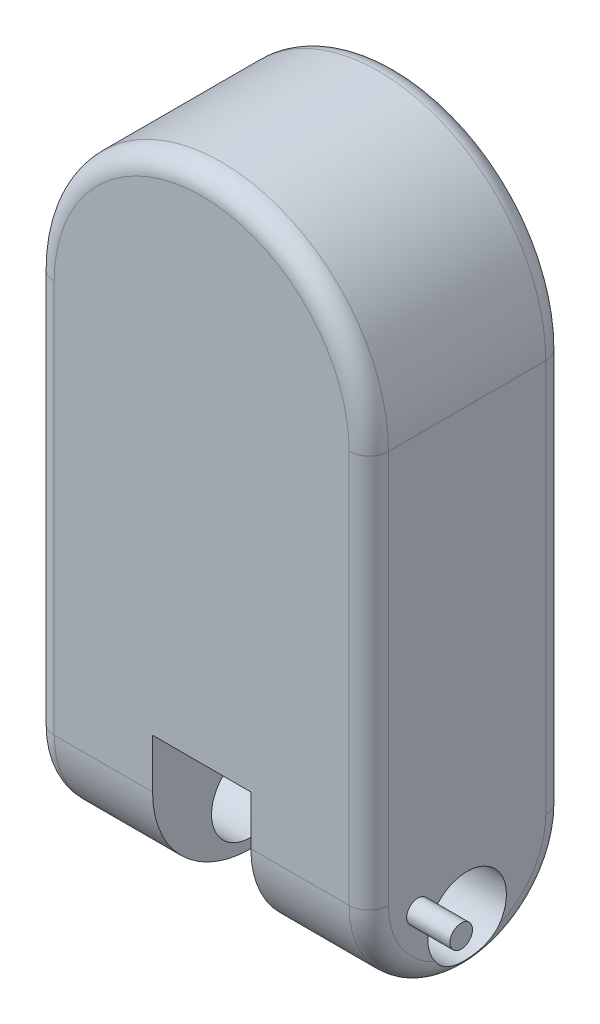
ISO-10303-21;
HEADER;
FILE_DESCRIPTION(('STEP AP214'),'2;1');
FILE_NAME('part.step','',(''),(''),'','','');
FILE_SCHEMA(('AUTOMOTIVE_DESIGN { 1 0 10303 214 1 1 1 1 }'));
ENDSEC;
DATA;
#1=APPLICATION_CONTEXT('core data for automotive mechanical design processes');
#2=APPLICATION_PROTOCOL_DEFINITION('international standard','automotive_design',2000,#1);
#3=PRODUCT_CONTEXT('',#1,'mechanical');
#4=PRODUCT('Part','Part','',(#3));
#5=PRODUCT_RELATED_PRODUCT_CATEGORY('part','',(#4));
#6=PRODUCT_DEFINITION_FORMATION('','',#4);
#7=PRODUCT_DEFINITION_CONTEXT('part definition',#1,'design');
#8=PRODUCT_DEFINITION('design','',#6,#7);
#9=PRODUCT_DEFINITION_SHAPE('','',#8);
#10=(LENGTH_UNIT() NAMED_UNIT(*) SI_UNIT(.MILLI.,.METRE.));
#11=(NAMED_UNIT(*) PLANE_ANGLE_UNIT() SI_UNIT($,.RADIAN.));
#12=(NAMED_UNIT(*) SI_UNIT($,.STERADIAN.) SOLID_ANGLE_UNIT());
#13=UNCERTAINTY_MEASURE_WITH_UNIT(LENGTH_MEASURE(1.E-05),#10,'distance_accuracy_value','');
#14=(GEOMETRIC_REPRESENTATION_CONTEXT(3) GLOBAL_UNCERTAINTY_ASSIGNED_CONTEXT((#13)) GLOBAL_UNIT_ASSIGNED_CONTEXT((#10,
#11,#12)) REPRESENTATION_CONTEXT('',''));
#15=CARTESIAN_POINT('',(0.,0.,0.));
#16=DIRECTION('',(0.,0.,1.));
#17=DIRECTION('',(1.,0.,0.));
#18=AXIS2_PLACEMENT_3D('',#15,#16,#17);
#19=CARTESIAN_POINT('',(-25.,-75.,-100.1));
#20=DIRECTION('',(0.,-1.,0.));
#21=DIRECTION('',(0.,0.,-1.));
#22=AXIS2_PLACEMENT_3D('',#19,#20,#21);
#23=PLANE('',#22);
#24=DIRECTION('',(1.,0.,0.));
#25=VECTOR('',#24,1.);
#26=CARTESIAN_POINT('',(-25.,-75.,-100.));
#27=LINE('',#26,#25);
#28=CARTESIAN_POINT('',(-25.,-75.,-100.));
#29=VERTEX_POINT('',#28);
#30=CARTESIAN_POINT('',(25.,-75.,-100.));
#31=VERTEX_POINT('',#30);
#32=EDGE_CURVE('E96',#29,#31,#27,.T.);
#33=ORIENTED_EDGE('',*,*,#32,.T.);
#34=CARTESIAN_POINT('',(23.5893264020334,-75.,-90.1));
#35=DIRECTION('',(0.,-1.,0.));
#36=DIRECTION('',(0.,0.,-1.));
#37=AXIS2_PLACEMENT_3D('',#34,#35,#36);
#38=CIRCLE('',#37,10.);
#39=CARTESIAN_POINT('',(23.5893264020334,-75.,-100.1));
#40=VERTEX_POINT('',#39);
#41=EDGE_CURVE('E12',#31,#40,#38,.F.);
#42=ORIENTED_EDGE('',*,*,#41,.T.);
#43=DIRECTION('',(1.,0.,0.));
#44=VECTOR('',#43,1.);
#45=CARTESIAN_POINT('',(-25.,-75.,-100.1));
#46=LINE('',#45,#44);
#47=CARTESIAN_POINT('',(-23.5893264020334,-75.,-100.1));
#48=VERTEX_POINT('',#47);
#49=EDGE_CURVE('E120',#48,#40,#46,.T.);
#50=ORIENTED_EDGE('',*,*,#49,.F.);
#51=CARTESIAN_POINT('',(-23.5893264020334,-75.,-90.1));
#52=DIRECTION('',(0.,-1.,0.));
#53=DIRECTION('',(0.,0.,-1.));
#54=AXIS2_PLACEMENT_3D('',#51,#52,#53);
#55=CIRCLE('',#54,10.);
#56=EDGE_CURVE('E59',#48,#29,#55,.F.);
#57=ORIENTED_EDGE('',*,*,#56,.T.);
#58=EDGE_LOOP('',(#33,#42,#50,#57));
#59=FACE_BOUND('',#58,.T.);
#60=ADVANCED_FACE('F50',(#59),#23,.F.);
#61=CARTESIAN_POINT('',(0.,0.,-100.1));
#62=DIRECTION('',(0.,0.,-1.));
#63=DIRECTION('',(-1.,0.,0.));
#64=AXIS2_PLACEMENT_3D('',#61,#62,#63);
#65=PLANE('',#64);
#66=ORIENTED_EDGE('',*,*,#49,.T.);
#67=DIRECTION('',(0.,1.,0.));
#68=VECTOR('',#67,1.);
#69=CARTESIAN_POINT('',(23.5893264020334,-105.,-100.1));
#70=LINE('',#69,#68);
#71=CARTESIAN_POINT('',(23.5893264020334,-103.589326402033,-100.1));
#72=VERTEX_POINT('',#71);
#73=EDGE_CURVE('E108',#40,#72,#70,.F.);
#74=ORIENTED_EDGE('',*,*,#73,.T.);
#75=DIRECTION('',(1.,0.,0.));
#76=VECTOR('',#75,1.);
#77=CARTESIAN_POINT('',(-25.,-103.589326402033,-100.1));
#78=LINE('',#77,#76);
#79=CARTESIAN_POINT('',(-23.5893264020334,-103.589326402033,-100.1));
#80=VERTEX_POINT('',#79);
#81=EDGE_CURVE('E74',#72,#80,#78,.F.);
#82=ORIENTED_EDGE('',*,*,#81,.T.);
#83=DIRECTION('',(0.,-1.,0.));
#84=VECTOR('',#83,1.);
#85=CARTESIAN_POINT('',(-23.5893264020334,-75.,-100.1));
#86=LINE('',#85,#84);
#87=EDGE_CURVE('E111',#80,#48,#86,.F.);
#88=ORIENTED_EDGE('',*,*,#87,.T.);
#89=EDGE_LOOP('',(#66,#74,#82,#88));
#90=FACE_BOUND('',#89,.T.);
#91=ADVANCED_FACE('F124',(#90),#65,.T.);
#92=CARTESIAN_POINT('',(0.,0.,-100.));
#93=DIRECTION('',(0.,0.,-1.));
#94=DIRECTION('',(-1.,0.,0.));
#95=AXIS2_PLACEMENT_3D('',#92,#93,#94);
#96=PLANE('',#95);
#97=ORIENTED_EDGE('',*,*,#32,.F.);
#98=DIRECTION('',(0.,1.,0.));
#99=VECTOR('',#98,1.);
#100=CARTESIAN_POINT('',(-25.,-105.,-100.));
#101=LINE('',#100,#99);
#102=CARTESIAN_POINT('',(-25.,-105.,-100.));
#103=VERTEX_POINT('',#102);
#104=EDGE_CURVE('E119',#103,#29,#101,.T.);
#105=ORIENTED_EDGE('',*,*,#104,.F.);
#106=DIRECTION('',(-1.,0.,0.));
#107=VECTOR('',#106,1.);
#108=CARTESIAN_POINT('',(25.,-105.,-100.));
#109=LINE('',#108,#107);
#110=CARTESIAN_POINT('',(25.,-105.,-100.));
#111=VERTEX_POINT('',#110);
#112=EDGE_CURVE('E99',#111,#103,#109,.T.);
#113=ORIENTED_EDGE('',*,*,#112,.F.);
#114=DIRECTION('',(0.,-1.,0.));
#115=VECTOR('',#114,1.);
#116=CARTESIAN_POINT('',(25.,-75.,-100.));
#117=LINE('',#116,#115);
#118=EDGE_CURVE('E93',#31,#111,#117,.T.);
#119=ORIENTED_EDGE('',*,*,#118,.F.);
#120=EDGE_LOOP('',(#97,#105,#113,#119));
#121=FACE_BOUND('',#120,.T.);
#122=ADVANCED_FACE('F95',(#121),#96,.F.);
#123=CARTESIAN_POINT('',(-23.5893264020334,-105.,-90.1));
#124=DIRECTION('',(0.,1.,0.));
#125=DIRECTION('',(0.,0.,1.));
#126=AXIS2_PLACEMENT_3D('',#123,#124,#125);
#127=CYLINDRICAL_SURFACE('',#126,10.);
#128=ORIENTED_EDGE('',*,*,#56,.F.);
#129=ORIENTED_EDGE('',*,*,#87,.F.);
#130=CARTESIAN_POINT('',(-23.5893264020334,-103.589326402033,-90.1));
#131=DIRECTION('',(-0.707106781186547,0.707106781186547,0.));
#132=DIRECTION('',(0.707106781186547,0.707106781186547,0.));
#133=AXIS2_PLACEMENT_3D('',#130,#131,#132);
#134=ELLIPSE('',#133,14.1421356237309,10.);
#135=EDGE_CURVE('E54',#103,#80,#134,.F.);
#136=ORIENTED_EDGE('',*,*,#135,.F.);
#137=ORIENTED_EDGE('',*,*,#104,.T.);
#138=EDGE_LOOP('',(#128,#129,#136,#137));
#139=FACE_BOUND('',#138,.T.);
#140=ADVANCED_FACE('F52',(#139),#127,.T.);
#141=CARTESIAN_POINT('',(25.,-103.589326402033,-90.1));
#142=DIRECTION('',(-1.,0.,0.));
#143=DIRECTION('',(0.,0.,1.));
#144=AXIS2_PLACEMENT_3D('',#141,#142,#143);
#145=CYLINDRICAL_SURFACE('',#144,10.);
#146=ORIENTED_EDGE('',*,*,#135,.T.);
#147=ORIENTED_EDGE('',*,*,#81,.F.);
#148=CARTESIAN_POINT('',(23.5893264020334,-103.589326402033,-90.1));
#149=DIRECTION('',(-0.707106781186547,-0.707106781186548,0.));
#150=DIRECTION('',(-0.707106781186548,0.707106781186547,0.));
#151=AXIS2_PLACEMENT_3D('',#148,#149,#150);
#152=ELLIPSE('',#151,14.142135623731,10.);
#153=EDGE_CURVE('E67',#111,#72,#152,.F.);
#154=ORIENTED_EDGE('',*,*,#153,.F.);
#155=ORIENTED_EDGE('',*,*,#112,.T.);
#156=EDGE_LOOP('',(#146,#147,#154,#155));
#157=FACE_BOUND('',#156,.T.);
#158=ADVANCED_FACE('F117',(#157),#145,.T.);
#159=CARTESIAN_POINT('',(23.5893264020334,-75.,-90.1));
#160=DIRECTION('',(0.,-1.,0.));
#161=DIRECTION('',(1.,0.,0.));
#162=AXIS2_PLACEMENT_3D('',#159,#160,#161);
#163=CYLINDRICAL_SURFACE('',#162,10.);
#164=ORIENTED_EDGE('',*,*,#41,.F.);
#165=ORIENTED_EDGE('',*,*,#118,.T.);
#166=ORIENTED_EDGE('',*,*,#153,.T.);
#167=ORIENTED_EDGE('',*,*,#73,.F.);
#168=EDGE_LOOP('',(#164,#165,#166,#167));
#169=FACE_BOUND('',#168,.T.);
#170=ADVANCED_FACE('F107',(#169),#163,.T.);
#171=CLOSED_SHELL('',(#60,#91,#122,#140,#158,#170));
#172=MANIFOLD_SOLID_BREP('B2',#171);
#173=CARTESIAN_POINT('',(0.,-75.,-50.));
#174=DIRECTION('',(1.,0.,0.));
#175=DIRECTION('',(0.,0.,-1.));
#176=AXIS2_PLACEMENT_3D('',#173,#174,#175);
#177=CYLINDRICAL_SURFACE('',#176,50.);
#178=DIRECTION('',(1.,0.,0.));
#179=VECTOR('',#178,1.);
#180=CARTESIAN_POINT('',(0.,-75.,0.));
#181=LINE('',#180,#179);
#182=CARTESIAN_POINT('',(-75.,-75.,0.));
#183=VERTEX_POINT('',#182);
#184=CARTESIAN_POINT('',(-25.,-75.,0.));
#185=VERTEX_POINT('',#184);
#186=EDGE_CURVE('E397',#183,#185,#181,.T.);
#187=ORIENTED_EDGE('',*,*,#186,.F.);
#188=CARTESIAN_POINT('',(-75.,-75.,-50.));
#189=DIRECTION('',(-1.,0.,0.));
#190=DIRECTION('',(0.,-1.,0.));
#191=AXIS2_PLACEMENT_3D('',#188,#189,#190);
#192=CIRCLE('',#191,50.);
#193=CARTESIAN_POINT('',(-75.,-125.,-50.));
#194=VERTEX_POINT('',#193);
#195=EDGE_CURVE('E197',#183,#194,#192,.F.);
#196=ORIENTED_EDGE('',*,*,#195,.T.);
#197=DIRECTION('',(1.,0.,0.));
#198=VECTOR('',#197,1.);
#199=CARTESIAN_POINT('',(-85.,-125.,-50.));
#200=LINE('',#199,#198);
#201=CARTESIAN_POINT('',(-25.,-125.,-50.));
#202=VERTEX_POINT('',#201);
#203=EDGE_CURVE('E353',#202,#194,#200,.F.);
#204=ORIENTED_EDGE('',*,*,#203,.F.);
#205=CARTESIAN_POINT('',(-25.,-75.,-50.));
#206=DIRECTION('',(-1.,0.,0.));
#207=DIRECTION('',(0.,0.,1.));
#208=AXIS2_PLACEMENT_3D('',#205,#206,#207);
#209=CIRCLE('',#208,50.);
#210=EDGE_CURVE('E372',#185,#202,#209,.F.);
#211=ORIENTED_EDGE('',*,*,#210,.F.);
#212=EDGE_LOOP('',(#187,#196,#204,#211));
#213=FACE_BOUND('',#212,.T.);
#214=ADVANCED_FACE('F174',(#213),#177,.T.);
#215=CARTESIAN_POINT('',(-85.,-75.,-50.));
#216=DIRECTION('',(-1.,0.,0.));
#217=DIRECTION('',(0.,0.,1.));
#218=AXIS2_PLACEMENT_3D('',#215,#216,#217);
#219=CYLINDRICAL_SURFACE('',#218,50.);
#220=ORIENTED_EDGE('',*,*,#203,.T.);
#221=CARTESIAN_POINT('',(-75.,-75.,-50.));
#222=DIRECTION('',(-1.,0.,0.));
#223=DIRECTION('',(0.,-1.,0.));
#224=AXIS2_PLACEMENT_3D('',#221,#222,#223);
#225=CIRCLE('',#224,50.);
#226=CARTESIAN_POINT('',(-75.,-75.,-100.));
#227=VERTEX_POINT('',#226);
#228=EDGE_CURVE('E183',#194,#227,#225,.F.);
#229=ORIENTED_EDGE('',*,*,#228,.T.);
#230=DIRECTION('',(1.,0.,0.));
#231=VECTOR('',#230,1.);
#232=CARTESIAN_POINT('',(-85.,-75.,-100.));
#233=LINE('',#232,#231);
#234=CARTESIAN_POINT('',(-25.,-75.,-100.));
#235=VERTEX_POINT('',#234);
#236=EDGE_CURVE('E392',#235,#227,#233,.F.);
#237=ORIENTED_EDGE('',*,*,#236,.F.);
#238=CARTESIAN_POINT('',(-25.,-75.,-50.));
#239=DIRECTION('',(-1.,0.,0.));
#240=DIRECTION('',(0.,0.,1.));
#241=AXIS2_PLACEMENT_3D('',#238,#239,#240);
#242=CIRCLE('',#241,50.);
#243=EDGE_CURVE('E381',#202,#235,#242,.F.);
#244=ORIENTED_EDGE('',*,*,#243,.F.);
#245=EDGE_LOOP('',(#220,#229,#237,#244));
#246=FACE_BOUND('',#245,.T.);
#247=ADVANCED_FACE('F510',(#246),#219,.T.);
#248=CARTESIAN_POINT('',(85.,125.,-100.));
#249=DIRECTION('',(1.,0.,0.));
#250=DIRECTION('',(0.,1.,0.));
#251=AXIS2_PLACEMENT_3D('',#248,#249,#250);
#252=PLANE('',#251);
#253=CARTESIAN_POINT('',(85.,-85.,-25.));
#254=DIRECTION('',(1.,0.,0.));
#255=DIRECTION('',(0.,1.,0.));
#256=AXIS2_PLACEMENT_3D('',#253,#254,#255);
#257=CIRCLE('',#256,5.75);
#258=CARTESIAN_POINT('',(85.,-79.25,-25.));
#259=VERTEX_POINT('',#258);
#260=EDGE_CURVE('E693',#259,#259,#257,.T.);
#261=ORIENTED_EDGE('',*,*,#260,.F.);
#262=EDGE_LOOP('',(#261));
#263=FACE_BOUND('',#262,.T.);
#264=CARTESIAN_POINT('',(85.,-75.,-50.));
#265=DIRECTION('',(1.,0.,0.));
#266=DIRECTION('',(0.,1.,0.));
#267=AXIS2_PLACEMENT_3D('',#264,#265,#266);
#268=CIRCLE('',#267,40.);
#269=CARTESIAN_POINT('',(85.0000000000001,-111.5,-66.3630681719536));
#270=VERTEX_POINT('',#269);
#271=CARTESIAN_POINT('',(85.,-75.,-90.));
#272=VERTEX_POINT('',#271);
#273=EDGE_CURVE('E429',#270,#272,#268,.T.);
#274=ORIENTED_EDGE('',*,*,#273,.T.);
#275=DIRECTION('',(0.,1.,0.));
#276=VECTOR('',#275,1.);
#277=CARTESIAN_POINT('',(85.,125.,-90.));
#278=LINE('',#277,#276);
#279=CARTESIAN_POINT('',(85.,125.,-90.));
#280=VERTEX_POINT('',#279);
#281=EDGE_CURVE('E432',#272,#280,#278,.T.);
#282=ORIENTED_EDGE('',*,*,#281,.T.);
#283=DIRECTION('',(0.,0.,1.));
#284=VECTOR('',#283,1.);
#285=CARTESIAN_POINT('',(85.,125.,-100.));
#286=LINE('',#285,#284);
#287=CARTESIAN_POINT('',(85.,125.,-9.99999999999999));
#288=VERTEX_POINT('',#287);
#289=EDGE_CURVE('E367',#280,#288,#286,.T.);
#290=ORIENTED_EDGE('',*,*,#289,.T.);
#291=DIRECTION('',(0.,1.,0.));
#292=VECTOR('',#291,1.);
#293=CARTESIAN_POINT('',(85.,125.,-9.99999999999999));
#294=LINE('',#293,#292);
#295=CARTESIAN_POINT('',(85.,-75.,-10.));
#296=VERTEX_POINT('',#295);
#297=EDGE_CURVE('E423',#288,#296,#294,.F.);
#298=ORIENTED_EDGE('',*,*,#297,.T.);
#299=CARTESIAN_POINT('',(85.,-75.,-50.));
#300=DIRECTION('',(1.,0.,0.));
#301=DIRECTION('',(0.,1.,0.));
#302=AXIS2_PLACEMENT_3D('',#299,#300,#301);
#303=CIRCLE('',#302,40.);
#304=CARTESIAN_POINT('',(85.,-111.5,-33.6369318280464));
#305=VERTEX_POINT('',#304);
#306=EDGE_CURVE('E426',#296,#305,#303,.T.);
#307=ORIENTED_EDGE('',*,*,#306,.T.);
#308=CARTESIAN_POINT('',(85.,-100.,-50.));
#309=DIRECTION('',(-1.,0.,0.));
#310=DIRECTION('',(0.,-1.,0.));
#311=AXIS2_PLACEMENT_3D('',#308,#309,#310);
#312=CIRCLE('',#311,20.);
#313=EDGE_CURVE('E354',#305,#270,#312,.T.);
#314=ORIENTED_EDGE('',*,*,#313,.T.);
#315=EDGE_LOOP('',(#274,#282,#290,#298,#307,#314));
#316=FACE_BOUND('',#315,.T.);
#317=ADVANCED_FACE('F515',(#263,#316),#252,.T.);
#318=CARTESIAN_POINT('',(-85.,125.,-100.));
#319=DIRECTION('',(-1.,0.,0.));
#320=DIRECTION('',(0.,-1.,0.));
#321=AXIS2_PLACEMENT_3D('',#318,#319,#320);
#322=PLANE('',#321);
#323=CARTESIAN_POINT('',(-85.,-75.,-50.));
#324=DIRECTION('',(-1.,0.,0.));
#325=DIRECTION('',(0.,-1.,0.));
#326=AXIS2_PLACEMENT_3D('',#323,#324,#325);
#327=CIRCLE('',#326,40.);
#328=CARTESIAN_POINT('',(-85.,-111.5,-33.6369318280464));
#329=VERTEX_POINT('',#328);
#330=CARTESIAN_POINT('',(-85.,-75.,-10.));
#331=VERTEX_POINT('',#330);
#332=EDGE_CURVE('E595',#329,#331,#327,.T.);
#333=ORIENTED_EDGE('',*,*,#332,.T.);
#334=DIRECTION('',(0.,-1.,0.));
#335=VECTOR('',#334,1.);
#336=CARTESIAN_POINT('',(-85.,125.,-9.99999999999999));
#337=LINE('',#336,#335);
#338=CARTESIAN_POINT('',(-85.,125.,-9.99999999999999));
#339=VERTEX_POINT('',#338);
#340=EDGE_CURVE('E481',#331,#339,#337,.F.);
#341=ORIENTED_EDGE('',*,*,#340,.T.);
#342=DIRECTION('',(0.,0.,1.));
#343=VECTOR('',#342,1.);
#344=CARTESIAN_POINT('',(-85.,125.,-100.));
#345=LINE('',#344,#343);
#346=CARTESIAN_POINT('',(-85.,125.,-90.));
#347=VERTEX_POINT('',#346);
#348=EDGE_CURVE('E368',#347,#339,#345,.T.);
#349=ORIENTED_EDGE('',*,*,#348,.F.);
#350=DIRECTION('',(0.,-1.,0.));
#351=VECTOR('',#350,1.);
#352=CARTESIAN_POINT('',(-85.,-75.,-90.));
#353=LINE('',#352,#351);
#354=CARTESIAN_POINT('',(-85.,-75.,-90.));
#355=VERTEX_POINT('',#354);
#356=EDGE_CURVE('E587',#347,#355,#353,.T.);
#357=ORIENTED_EDGE('',*,*,#356,.T.);
#358=CARTESIAN_POINT('',(-85.,-75.,-50.));
#359=DIRECTION('',(-1.,0.,0.));
#360=DIRECTION('',(0.,-1.,0.));
#361=AXIS2_PLACEMENT_3D('',#358,#359,#360);
#362=CIRCLE('',#361,40.);
#363=CARTESIAN_POINT('',(-85.,-111.5,-66.3630681719536));
#364=VERTEX_POINT('',#363);
#365=EDGE_CURVE('E593',#355,#364,#362,.T.);
#366=ORIENTED_EDGE('',*,*,#365,.T.);
#367=CARTESIAN_POINT('',(-85.,-100.,-50.));
#368=DIRECTION('',(-1.,0.,0.));
#369=DIRECTION('',(0.,-1.,0.));
#370=AXIS2_PLACEMENT_3D('',#367,#368,#369);
#371=CIRCLE('',#370,20.);
#372=EDGE_CURVE('E359',#329,#364,#371,.T.);
#373=ORIENTED_EDGE('',*,*,#372,.F.);
#374=EDGE_LOOP('',(#333,#341,#349,#357,#366,#373));
#375=FACE_BOUND('',#374,.T.);
#376=ADVANCED_FACE('F602',(#375),#322,.T.);
#377=CARTESIAN_POINT('',(0.,0.,-100.));
#378=DIRECTION('',(0.,0.,1.));
#379=DIRECTION('',(1.,0.,0.));
#380=AXIS2_PLACEMENT_3D('',#377,#378,#379);
#381=PLANE('',#380);
#382=CARTESIAN_POINT('',(0.,125.,-100.));
#383=DIRECTION('',(0.,0.,1.));
#384=DIRECTION('',(1.,0.,0.));
#385=AXIS2_PLACEMENT_3D('',#382,#383,#384);
#386=CIRCLE('',#385,75.);
#387=CARTESIAN_POINT('',(-75.,125.,-100.));
#388=VERTEX_POINT('',#387);
#389=CARTESIAN_POINT('',(75.,125.,-100.));
#390=VERTEX_POINT('',#389);
#391=EDGE_CURVE('E416',#388,#390,#386,.F.);
#392=ORIENTED_EDGE('',*,*,#391,.T.);
#393=DIRECTION('',(0.,1.,0.));
#394=VECTOR('',#393,1.);
#395=CARTESIAN_POINT('',(75.,-75.,-100.));
#396=LINE('',#395,#394);
#397=CARTESIAN_POINT('',(75.,-75.,-100.));
#398=VERTEX_POINT('',#397);
#399=EDGE_CURVE('E420',#390,#398,#396,.F.);
#400=ORIENTED_EDGE('',*,*,#399,.T.);
#401=CARTESIAN_POINT('',(25.,-75.,-100.));
#402=VERTEX_POINT('',#401);
#403=EDGE_CURVE('E398',#398,#402,#233,.F.);
#404=ORIENTED_EDGE('',*,*,#403,.T.);
#405=DIRECTION('',(-1.,0.,0.));
#406=VECTOR('',#405,1.);
#407=CARTESIAN_POINT('',(-25.,-75.,-100.));
#408=LINE('',#407,#406);
#409=EDGE_CURVE('E345',#402,#235,#408,.T.);
#410=ORIENTED_EDGE('',*,*,#409,.T.);
#411=ORIENTED_EDGE('',*,*,#236,.T.);
#412=DIRECTION('',(0.,-1.,0.));
#413=VECTOR('',#412,1.);
#414=CARTESIAN_POINT('',(-75.,125.,-100.));
#415=LINE('',#414,#413);
#416=EDGE_CURVE('E413',#227,#388,#415,.F.);
#417=ORIENTED_EDGE('',*,*,#416,.T.);
#418=EDGE_LOOP('',(#392,#400,#404,#410,#411,#417));
#419=FACE_BOUND('',#418,.T.);
#420=ADVANCED_FACE('F650',(#419),#381,.F.);
#421=CARTESIAN_POINT('',(0.,0.,0.));
#422=DIRECTION('',(0.,0.,1.));
#423=DIRECTION('',(1.,0.,0.));
#424=AXIS2_PLACEMENT_3D('',#421,#422,#423);
#425=PLANE('',#424);
#426=DIRECTION('',(0.,-1.,0.));
#427=VECTOR('',#426,1.);
#428=CARTESIAN_POINT('',(-25.,-75.,0.));
#429=LINE('',#428,#427);
#430=CARTESIAN_POINT('',(-25.,-50.,0.));
#431=VERTEX_POINT('',#430);
#432=EDGE_CURVE('E321',#431,#185,#429,.T.);
#433=ORIENTED_EDGE('',*,*,#432,.F.);
#434=DIRECTION('',(-1.,0.,0.));
#435=VECTOR('',#434,1.);
#436=CARTESIAN_POINT('',(-25.,-50.,0.));
#437=LINE('',#436,#435);
#438=CARTESIAN_POINT('',(25.,-50.,0.));
#439=VERTEX_POINT('',#438);
#440=EDGE_CURVE('E332',#439,#431,#437,.T.);
#441=ORIENTED_EDGE('',*,*,#440,.F.);
#442=DIRECTION('',(0.,1.,0.));
#443=VECTOR('',#442,1.);
#444=CARTESIAN_POINT('',(25.,-50.,0.));
#445=LINE('',#444,#443);
#446=CARTESIAN_POINT('',(25.,-75.,0.));
#447=VERTEX_POINT('',#446);
#448=EDGE_CURVE('E310',#447,#439,#445,.T.);
#449=ORIENTED_EDGE('',*,*,#448,.F.);
#450=CARTESIAN_POINT('',(75.,-75.,0.));
#451=VERTEX_POINT('',#450);
#452=EDGE_CURVE('E401',#447,#451,#181,.T.);
#453=ORIENTED_EDGE('',*,*,#452,.T.);
#454=DIRECTION('',(0.,1.,0.));
#455=VECTOR('',#454,1.);
#456=CARTESIAN_POINT('',(75.,0.,0.));
#457=LINE('',#456,#455);
#458=CARTESIAN_POINT('',(75.,125.,0.));
#459=VERTEX_POINT('',#458);
#460=EDGE_CURVE('E575',#451,#459,#457,.T.);
#461=ORIENTED_EDGE('',*,*,#460,.T.);
#462=CARTESIAN_POINT('',(0.,125.,0.));
#463=DIRECTION('',(0.,0.,1.));
#464=DIRECTION('',(1.,0.,0.));
#465=AXIS2_PLACEMENT_3D('',#462,#463,#464);
#466=CIRCLE('',#465,75.);
#467=CARTESIAN_POINT('',(-75.,125.,0.));
#468=VERTEX_POINT('',#467);
#469=EDGE_CURVE('E580',#459,#468,#466,.T.);
#470=ORIENTED_EDGE('',*,*,#469,.T.);
#471=DIRECTION('',(0.,-1.,0.));
#472=VECTOR('',#471,1.);
#473=CARTESIAN_POINT('',(-75.,0.,0.));
#474=LINE('',#473,#472);
#475=EDGE_CURVE('E543',#468,#183,#474,.T.);
#476=ORIENTED_EDGE('',*,*,#475,.T.);
#477=ORIENTED_EDGE('',*,*,#186,.T.);
#478=EDGE_LOOP('',(#433,#441,#449,#453,#461,#470,#476,#477));
#479=FACE_BOUND('',#478,.T.);
#480=ADVANCED_FACE('F662',(#479),#425,.T.);
#481=CARTESIAN_POINT('',(25.,-150.,-100.));
#482=DIRECTION('',(1.,0.,0.));
#483=DIRECTION('',(0.,0.,-1.));
#484=AXIS2_PLACEMENT_3D('',#481,#482,#483);
#485=PLANE('',#484);
#486=CARTESIAN_POINT('',(25.,-75.,-50.));
#487=DIRECTION('',(1.,0.,0.));
#488=DIRECTION('',(0.,0.,-1.));
#489=AXIS2_PLACEMENT_3D('',#486,#487,#488);
#490=CIRCLE('',#489,50.);
#491=CARTESIAN_POINT('',(25.,-125.,-50.));
#492=VERTEX_POINT('',#491);
#493=EDGE_CURVE('E385',#492,#447,#490,.F.);
#494=ORIENTED_EDGE('',*,*,#493,.T.);
#495=ORIENTED_EDGE('',*,*,#448,.T.);
#496=DIRECTION('',(0.,0.,1.));
#497=VECTOR('',#496,1.);
#498=CARTESIAN_POINT('',(25.,-50.,-99.));
#499=LINE('',#498,#497);
#500=CARTESIAN_POINT('',(25.,-50.,-99.));
#501=VERTEX_POINT('',#500);
#502=EDGE_CURVE('E302',#501,#439,#499,.T.);
#503=ORIENTED_EDGE('',*,*,#502,.F.);
#504=DIRECTION('',(0.,1.,0.));
#505=VECTOR('',#504,1.);
#506=CARTESIAN_POINT('',(25.,-50.,-99.));
#507=LINE('',#506,#505);
#508=CARTESIAN_POINT('',(25.,-74.4302970896538,-99.));
#509=VERTEX_POINT('',#508);
#510=EDGE_CURVE('E308',#509,#501,#507,.T.);
#511=ORIENTED_EDGE('',*,*,#510,.F.);
#512=CARTESIAN_POINT('',(25.,-161.602540378444,-50.));
#513=DIRECTION('',(1.,0.,0.));
#514=DIRECTION('',(0.,0.,-1.));
#515=AXIS2_PLACEMENT_3D('',#512,#513,#514);
#516=CIRCLE('',#515,100.);
#517=EDGE_CURVE('E346',#402,#509,#516,.T.);
#518=ORIENTED_EDGE('',*,*,#517,.F.);
#519=CARTESIAN_POINT('',(25.,-75.,-50.));
#520=DIRECTION('',(1.,0.,0.));
#521=DIRECTION('',(0.,0.,-1.));
#522=AXIS2_PLACEMENT_3D('',#519,#520,#521);
#523=CIRCLE('',#522,50.);
#524=EDGE_CURVE('E388',#402,#492,#523,.F.);
#525=ORIENTED_EDGE('',*,*,#524,.T.);
#526=EDGE_LOOP('',(#494,#495,#503,#511,#518,#525));
#527=FACE_BOUND('',#526,.T.);
#528=CARTESIAN_POINT('',(25.,-100.,-50.));
#529=DIRECTION('',(1.,0.,0.));
#530=DIRECTION('',(0.,0.,-1.));
#531=AXIS2_PLACEMENT_3D('',#528,#529,#530);
#532=CIRCLE('',#531,20.);
#533=CARTESIAN_POINT('',(25.,-100.,-70.));
#534=VERTEX_POINT('',#533);
#535=EDGE_CURVE('E363',#534,#534,#532,.T.);
#536=ORIENTED_EDGE('',*,*,#535,.T.);
#537=EDGE_LOOP('',(#536));
#538=FACE_BOUND('',#537,.T.);
#539=ADVANCED_FACE('F305',(#527,#538),#485,.F.);
#540=CARTESIAN_POINT('',(-25.,-150.,-100.));
#541=DIRECTION('',(-1.,0.,0.));
#542=DIRECTION('',(0.,0.,1.));
#543=AXIS2_PLACEMENT_3D('',#540,#541,#542);
#544=PLANE('',#543);
#545=ORIENTED_EDGE('',*,*,#432,.T.);
#546=ORIENTED_EDGE('',*,*,#210,.T.);
#547=ORIENTED_EDGE('',*,*,#243,.T.);
#548=CARTESIAN_POINT('',(-25.,-161.602540378444,-50.));
#549=DIRECTION('',(1.,0.,0.));
#550=DIRECTION('',(0.,0.,-1.));
#551=AXIS2_PLACEMENT_3D('',#548,#549,#550);
#552=CIRCLE('',#551,100.);
#553=CARTESIAN_POINT('',(-25.,-74.4302970896538,-99.));
#554=VERTEX_POINT('',#553);
#555=EDGE_CURVE('E341',#235,#554,#552,.T.);
#556=ORIENTED_EDGE('',*,*,#555,.T.);
#557=DIRECTION('',(0.,-1.,0.));
#558=VECTOR('',#557,1.);
#559=CARTESIAN_POINT('',(-25.,-75.,-99.));
#560=LINE('',#559,#558);
#561=CARTESIAN_POINT('',(-25.,-50.,-99.));
#562=VERTEX_POINT('',#561);
#563=EDGE_CURVE('E190',#562,#554,#560,.T.);
#564=ORIENTED_EDGE('',*,*,#563,.F.);
#565=DIRECTION('',(0.,0.,1.));
#566=VECTOR('',#565,1.);
#567=CARTESIAN_POINT('',(-25.,-50.,-99.));
#568=LINE('',#567,#566);
#569=EDGE_CURVE('E316',#562,#431,#568,.T.);
#570=ORIENTED_EDGE('',*,*,#569,.T.);
#571=EDGE_LOOP('',(#545,#546,#547,#556,#564,#570));
#572=FACE_BOUND('',#571,.T.);
#573=CARTESIAN_POINT('',(-25.,-100.,-50.));
#574=DIRECTION('',(-1.,0.,0.));
#575=DIRECTION('',(0.,0.,1.));
#576=AXIS2_PLACEMENT_3D('',#573,#574,#575);
#577=CIRCLE('',#576,20.);
#578=CARTESIAN_POINT('',(-25.,-100.,-30.));
#579=VERTEX_POINT('',#578);
#580=EDGE_CURVE('E358',#579,#579,#577,.T.);
#581=ORIENTED_EDGE('',*,*,#580,.T.);
#582=EDGE_LOOP('',(#581));
#583=FACE_BOUND('',#582,.T.);
#584=ADVANCED_FACE('F465',(#572,#583),#544,.F.);
#585=CARTESIAN_POINT('',(85.,-100.,-50.));
#586=DIRECTION('',(-1.,0.,0.));
#587=DIRECTION('',(0.,-1.,0.));
#588=AXIS2_PLACEMENT_3D('',#585,#586,#587);
#589=CYLINDRICAL_SURFACE('',#588,20.);
#590=CARTESIAN_POINT('',(-85.,-111.5,-66.3630681719536));
#591=CARTESIAN_POINT('',(-84.9999944988369,-111.717635786294,-66.2101150233157));
#592=CARTESIAN_POINT('',(-84.9972251505422,-111.932182024762,-66.0528421805291));
#593=CARTESIAN_POINT('',(-84.9867556613727,-112.35473388776,-65.7299474304971));
#594=CARTESIAN_POINT('',(-84.9790561221654,-112.562740307143,-65.5643265442968));
#595=CARTESIAN_POINT('',(-84.9494718778201,-113.176161814739,-65.0555886797702));
#596=CARTESIAN_POINT('',(-84.9210996400918,-113.571325329765,-64.7003530754296));
#597=CARTESIAN_POINT('',(-84.8515096756831,-114.330811895632,-63.9609577577295));
#598=CARTESIAN_POINT('',(-84.8103152955771,-114.695189480587,-63.576851568469));
#599=CARTESIAN_POINT('',(-84.7190573029856,-115.391950208584,-62.7815251896323));
#600=CARTESIAN_POINT('',(-84.6689923089183,-115.724328355308,-62.3703007827167));
#601=CARTESIAN_POINT('',(-84.5631593930954,-116.358618976357,-61.5187034560061));
#602=CARTESIAN_POINT('',(-84.5073357106278,-116.660163582177,-61.0780636594513));
#603=CARTESIAN_POINT('',(-84.3940622995594,-117.226993438192,-60.1742441935076));
#604=CARTESIAN_POINT('',(-84.3366125479803,-117.492278175682,-59.7110642055318));
#605=CARTESIAN_POINT('',(-84.223501755816,-117.985054029716,-58.7648363026767));
#606=CARTESIAN_POINT('',(-84.167840615512,-118.212547256171,-58.2817894988468));
#607=CARTESIAN_POINT('',(-84.0614849028067,-118.628363325728,-57.2985605452277));
#608=CARTESIAN_POINT('',(-84.0107905215469,-118.816684661646,-56.7983777369727));
#609=CARTESIAN_POINT('',(-83.914628020795,-119.162335252227,-55.7553050669512));
#610=CARTESIAN_POINT('',(-83.8696146444547,-119.31732359583,-55.2115959974652));
#611=CARTESIAN_POINT('',(-83.7912772213223,-119.580856141992,-54.1121164115952));
#612=CARTESIAN_POINT('',(-83.7579530630838,-119.689400787352,-53.5563460102591));
#613=CARTESIAN_POINT('',(-83.7183397843355,-119.816752364834,-52.7160701639446));
#614=CARTESIAN_POINT('',(-83.7068534918599,-119.853323941299,-52.434388327726));
#615=CARTESIAN_POINT('',(-83.6875556329067,-119.914450380322,-51.869577925022));
#616=CARTESIAN_POINT('',(-83.6797440577708,-119.939005271195,-51.586449361947));
#617=CARTESIAN_POINT('',(-83.6679366207012,-119.976034163262,-51.0192418997108));
#618=CARTESIAN_POINT('',(-83.6639419207102,-119.988504485659,-50.7351627375596));
#619=CARTESIAN_POINT('',(-83.6598264732936,-120.001327339773,-50.1666967726028));
#620=CARTESIAN_POINT('',(-83.6597058137055,-120.001679596733,-49.882309962968));
#621=CARTESIAN_POINT('',(-83.6615493262836,-119.995960582491,-49.5980542531014));
#622=B_SPLINE_CURVE_WITH_KNOTS('',3,(#590,#591,#592,#593,#594,#595,#596,#597,#598,#599,#600,
#601,#602,#603,#604,#605,#606,#607,#608,#609,#610,#611,#612,#613,#614,#615,#616,#617,#618,#619,
#620,#621),.UNSPECIFIED.,.F.,.F.,(4,2,2,2,2,2,2,2,2,2,2,2,2,2,2,4),(0.,0.797874642750538,
1.59565193352406,3.18994126089919,4.78134451960053,6.37299585463969,7.9818400114366,
9.59070691451069,11.1994839638914,12.8083229014095,14.5077128583875,16.2070866127463,
17.0596892460926,17.91228987052,18.7651499631725,19.6180293930039),.UNSPECIFIED.);
#623=CARTESIAN_POINT('',(-83.6602540378444,-120.,-50.));
#624=VERTEX_POINT('',#623);
#625=EDGE_CURVE('E472',#364,#624,#622,.T.);
#626=ORIENTED_EDGE('',*,*,#625,.T.);
#627=CARTESIAN_POINT('',(-83.6602540378444,-120.,-50.));
#628=CARTESIAN_POINT('',(-83.660247528865,-120.000000557423,-49.7291162562174));
#629=CARTESIAN_POINT('',(-83.6620203059655,-119.994495715576,-49.4582663052626));
#630=CARTESIAN_POINT('',(-83.6690632302412,-119.972496289671,-48.9170644816353));
#631=CARTESIAN_POINT('',(-83.6743333002116,-119.956001948214,-48.6467125980998));
#632=CARTESIAN_POINT('',(-83.6952902819852,-119.8900894424,-47.8373209986367));
#633=CARTESIAN_POINT('',(-83.7161240917141,-119.824241746037,-47.2996541799824));
#634=CARTESIAN_POINT('',(-83.7701739357349,-119.649543192614,-46.2334838396406));
#635=CARTESIAN_POINT('',(-83.8033583037589,-119.540802269524,-45.7049604702912));
#636=CARTESIAN_POINT('',(-83.8801161670473,-119.281208901752,-44.6590938773701));
#637=CARTESIAN_POINT('',(-83.9236903013259,-119.130353866779,-44.1417513436021));
#638=CARTESIAN_POINT('',(-84.0189152913429,-118.786789461718,-43.1189296044383));
#639=CARTESIAN_POINT('',(-84.0706068716683,-118.593867036125,-42.6135258599768));
#640=CARTESIAN_POINT('',(-84.1788835403941,-118.16796707267,-41.6204488654864));
#641=CARTESIAN_POINT('',(-84.2354685830894,-117.934989908899,-41.1327754499163));
#642=CARTESIAN_POINT('',(-84.3502215235499,-117.430402873405,-40.1779497284365));
#643=CARTESIAN_POINT('',(-84.4083896442132,-117.158787538414,-39.7108003367798));
#644=CARTESIAN_POINT('',(-84.5227473765823,-116.578517537487,-38.7998012021265));
#645=CARTESIAN_POINT('',(-84.5789368427548,-116.269860154377,-38.3559531718098));
#646=CARTESIAN_POINT('',(-84.6878982994192,-115.602912464245,-37.4753289636808));
#647=CARTESIAN_POINT('',(-84.740412180585,-115.243038677624,-37.0397174887075));
#648=CARTESIAN_POINT('',(-84.8345685865418,-114.487138492257,-36.1999281519389));
#649=CARTESIAN_POINT('',(-84.8762127470129,-114.09111754507,-35.7957455671454));
#650=CARTESIAN_POINT('',(-84.9437724111679,-113.26432007541,-35.0206968408248));
#651=CARTESIAN_POINT('',(-84.969646571122,-112.833455521703,-34.6499204268788));
#652=CARTESIAN_POINT('',(-84.992406932906,-112.164262783443,-34.1219764911395));
#653=CARTESIAN_POINT('',(-84.997317042392,-111.937265917523,-33.9506217314705));
#654=CARTESIAN_POINT('',(-85.001019493978,-111.47611190923,-33.6177002554482));
#655=CARTESIAN_POINT('',(-84.9998109947272,-111.241953786537,-33.4561348882949));
#656=CARTESIAN_POINT('',(-84.9951651075579,-111.004453188326,-33.299640422256));
#657=B_SPLINE_CURVE_WITH_KNOTS('',3,(#627,#628,#629,#630,#631,#632,#633,#634,#635,#636,#637,
#638,#639,#640,#641,#642,#643,#644,#645,#646,#647,#648,#649,#650,#651,#652,#653,#654,#655,#656),
.UNSPECIFIED.,.F.,.F.,(4,2,2,2,2,2,2,2,2,2,2,2,2,2,4),(0.,0.81252243782489,1.62502693931455,
3.24916534614429,4.86916790626039,6.48927012904759,8.1177764581638,9.74626757863837,
11.3749891898565,13.0038303470725,14.704137296452,16.404188235224,18.1086771866605,
18.9617565600298,19.8149532408674),.UNSPECIFIED.);
#658=EDGE_CURVE('E480',#624,#329,#657,.T.);
#659=ORIENTED_EDGE('',*,*,#658,.T.);
#660=ORIENTED_EDGE('',*,*,#372,.T.);
#661=EDGE_LOOP('',(#626,#659,#660));
#662=FACE_BOUND('',#661,.T.);
#663=ORIENTED_EDGE('',*,*,#580,.F.);
#664=EDGE_LOOP('',(#663));
#665=FACE_BOUND('',#664,.T.);
#666=ADVANCED_FACE('F461',(#662,#665),#589,.F.);
#667=CARTESIAN_POINT('',(85.,-111.5,-33.6369318280464));
#668=CARTESIAN_POINT('',(84.9999944988369,-111.717635786294,-33.7898849766843));
#669=CARTESIAN_POINT('',(84.9972251505423,-111.932182024762,-33.9471578194709));
#670=CARTESIAN_POINT('',(84.9867556613727,-112.35473388776,-34.270052569503));
#671=CARTESIAN_POINT('',(84.9790561221654,-112.562740307143,-34.4356734557032));
#672=CARTESIAN_POINT('',(84.9494718778202,-113.176161814739,-34.9444113202299));
#673=CARTESIAN_POINT('',(84.9210996400919,-113.571325329765,-35.2996469245705));
#674=CARTESIAN_POINT('',(84.8515096756831,-114.330811895632,-36.0390422422705));
#675=CARTESIAN_POINT('',(84.8103152955772,-114.695189480587,-36.4231484315311));
#676=CARTESIAN_POINT('',(84.7190573029856,-115.391950208584,-37.2184748103677));
#677=CARTESIAN_POINT('',(84.6689923089184,-115.724328355308,-37.6296992172834));
#678=CARTESIAN_POINT('',(84.5631593930955,-116.358618976357,-38.481296543994));
#679=CARTESIAN_POINT('',(84.5073357106278,-116.660163582177,-38.9219363405488));
#680=CARTESIAN_POINT('',(84.3940622995595,-117.226993438192,-39.8257558064925));
#681=CARTESIAN_POINT('',(84.3366125479804,-117.492278175682,-40.2889357944682));
#682=CARTESIAN_POINT('',(84.223501755816,-117.985054029716,-41.2351636973234));
#683=CARTESIAN_POINT('',(84.1678406155121,-118.212547256171,-41.7182105011533));
#684=CARTESIAN_POINT('',(84.0614849028068,-118.628363325728,-42.7014394547724));
#685=CARTESIAN_POINT('',(84.010790521547,-118.816684661646,-43.2016222630274));
#686=CARTESIAN_POINT('',(83.914628020795,-119.162335252227,-44.2446949330489));
#687=CARTESIAN_POINT('',(83.8696146444547,-119.31732359583,-44.7884040025349));
#688=CARTESIAN_POINT('',(83.7912772213223,-119.580856141992,-45.8878835884048));
#689=CARTESIAN_POINT('',(83.7579530630839,-119.689400787352,-46.443653989741));
#690=CARTESIAN_POINT('',(83.7183397843356,-119.816752364834,-47.2839298360555));
#691=CARTESIAN_POINT('',(83.7068534918599,-119.853323941299,-47.5656116722741));
#692=CARTESIAN_POINT('',(83.6875556329068,-119.914450380322,-48.1304220749781));
#693=CARTESIAN_POINT('',(83.6797440577709,-119.939005271195,-48.4135506380531));
#694=CARTESIAN_POINT('',(83.6679366207012,-119.976034163262,-48.9807581002893));
#695=CARTESIAN_POINT('',(83.6639419207103,-119.988504485659,-49.2648372624404));
#696=CARTESIAN_POINT('',(83.6598264732937,-120.001327339773,-49.8333032273972));
#697=CARTESIAN_POINT('',(83.6597058137055,-120.001679596733,-50.1176900370321));
#698=CARTESIAN_POINT('',(83.6615493262836,-119.995960582491,-50.4019457468987));
#699=B_SPLINE_CURVE_WITH_KNOTS('',3,(#667,#668,#669,#670,#671,#672,#673,#674,#675,#676,#677,
#678,#679,#680,#681,#682,#683,#684,#685,#686,#687,#688,#689,#690,#691,#692,#693,#694,#695,#696,
#697,#698),.UNSPECIFIED.,.F.,.F.,(4,2,2,2,2,2,2,2,2,2,2,2,2,2,2,4),(0.,0.797874642750553,
1.59565193352408,3.18994126089918,4.7813445196005,6.3729958546397,7.98184001143661,
9.59070691451071,11.1994839638915,12.8083229014096,14.5077128583875,16.2070866127463,
17.0596892460926,17.91228987052,18.7651499631725,19.6180293930039),.UNSPECIFIED.);
#700=CARTESIAN_POINT('',(83.6602540378444,-120.,-50.));
#701=VERTEX_POINT('',#700);
#702=EDGE_CURVE('E435',#305,#701,#699,.T.);
#703=ORIENTED_EDGE('',*,*,#702,.T.);
#704=CARTESIAN_POINT('',(83.6602540378444,-120.,-50.));
#705=CARTESIAN_POINT('',(83.660247528865,-120.000000557423,-50.2708837437826));
#706=CARTESIAN_POINT('',(83.6620203059656,-119.994495715576,-50.5417336947374));
#707=CARTESIAN_POINT('',(83.6690632302413,-119.972496289671,-51.0829355183647));
#708=CARTESIAN_POINT('',(83.6743333002116,-119.956001948214,-51.3532874019002));
#709=CARTESIAN_POINT('',(83.6952902819852,-119.8900894424,-52.1626790013634));
#710=CARTESIAN_POINT('',(83.7161240917141,-119.824241746037,-52.7003458200177));
#711=CARTESIAN_POINT('',(83.7701739357349,-119.649543192614,-53.7665161603594));
#712=CARTESIAN_POINT('',(83.8033583037589,-119.540802269524,-54.2950395297088));
#713=CARTESIAN_POINT('',(83.8801161670473,-119.281208901752,-55.3409061226299));
#714=CARTESIAN_POINT('',(83.9236903013259,-119.130353866779,-55.8582486563979));
#715=CARTESIAN_POINT('',(84.0189152913429,-118.786789461718,-56.8810703955617));
#716=CARTESIAN_POINT('',(84.0706068716683,-118.593867036125,-57.3864741400232));
#717=CARTESIAN_POINT('',(84.1788835403941,-118.16796707267,-58.3795511345136));
#718=CARTESIAN_POINT('',(84.2354685830894,-117.934989908899,-58.8672245500837));
#719=CARTESIAN_POINT('',(84.35022152355,-117.430402873405,-59.8220502715635));
#720=CARTESIAN_POINT('',(84.4083896442133,-117.158787538414,-60.2891996632202));
#721=CARTESIAN_POINT('',(84.5227473765824,-116.578517537487,-61.2001987978735));
#722=CARTESIAN_POINT('',(84.5789368427548,-116.269860154377,-61.6440468281903));
#723=CARTESIAN_POINT('',(84.6878982994192,-115.602912464245,-62.5246710363192));
#724=CARTESIAN_POINT('',(84.740412180585,-115.243038677624,-62.9602825112926));
#725=CARTESIAN_POINT('',(84.8345685865418,-114.487138492257,-63.8000718480611));
#726=CARTESIAN_POINT('',(84.8762127470129,-114.09111754507,-64.2042544328546));
#727=CARTESIAN_POINT('',(84.943772411168,-113.26432007541,-64.9793031591752));
#728=CARTESIAN_POINT('',(84.969646571122,-112.833455521703,-65.3500795731212));
#729=CARTESIAN_POINT('',(84.992406932906,-112.164262783443,-65.8780235088606));
#730=CARTESIAN_POINT('',(84.9973170423921,-111.937265917523,-66.0493782685295));
#731=CARTESIAN_POINT('',(85.001019493978,-111.47611190923,-66.3822997445518));
#732=CARTESIAN_POINT('',(84.9998109947272,-111.241953786537,-66.5438651117052));
#733=CARTESIAN_POINT('',(84.9951651075579,-111.004453188326,-66.700359577744));
#734=B_SPLINE_CURVE_WITH_KNOTS('',3,(#704,#705,#706,#707,#708,#709,#710,#711,#712,#713,#714,
#715,#716,#717,#718,#719,#720,#721,#722,#723,#724,#725,#726,#727,#728,#729,#730,#731,#732,#733),
.UNSPECIFIED.,.F.,.F.,(4,2,2,2,2,2,2,2,2,2,2,2,2,2,4),(0.,0.81252243782489,1.62502693931456,
3.24916534614429,4.86916790626037,6.48927012904759,8.11777645816379,9.74626757863837,
11.3749891898565,13.0038303470725,14.7041372964521,16.404188235224,18.1086771866605,
18.9617565600298,19.8149532408674),.UNSPECIFIED.);
#735=EDGE_CURVE('E444',#701,#270,#734,.T.);
#736=ORIENTED_EDGE('',*,*,#735,.T.);
#737=ORIENTED_EDGE('',*,*,#313,.F.);
#738=EDGE_LOOP('',(#703,#736,#737));
#739=FACE_BOUND('',#738,.T.);
#740=ORIENTED_EDGE('',*,*,#535,.F.);
#741=EDGE_LOOP('',(#740));
#742=FACE_BOUND('',#741,.T.);
#743=ADVANCED_FACE('F455',(#739,#742),#589,.F.);
#744=DIRECTION('',(1.,0.,0.));
#745=VECTOR('',#744,1.);
#746=CARTESIAN_POINT('',(55.,-125.,-50.));
#747=LINE('',#746,#745);
#748=CARTESIAN_POINT('',(75.,-125.,-50.));
#749=VERTEX_POINT('',#748);
#750=EDGE_CURVE('E393',#749,#492,#747,.F.);
#751=ORIENTED_EDGE('',*,*,#750,.F.);
#752=CARTESIAN_POINT('',(75.,-75.,-50.));
#753=DIRECTION('',(1.,0.,0.));
#754=DIRECTION('',(0.,1.,0.));
#755=AXIS2_PLACEMENT_3D('',#752,#753,#754);
#756=CIRCLE('',#755,50.);
#757=EDGE_CURVE('E530',#749,#451,#756,.F.);
#758=ORIENTED_EDGE('',*,*,#757,.T.);
#759=ORIENTED_EDGE('',*,*,#452,.F.);
#760=ORIENTED_EDGE('',*,*,#493,.F.);
#761=EDGE_LOOP('',(#751,#758,#759,#760));
#762=FACE_BOUND('',#761,.T.);
#763=ADVANCED_FACE('F460',(#762),#177,.T.);
#764=ORIENTED_EDGE('',*,*,#403,.F.);
#765=CARTESIAN_POINT('',(75.,-75.,-50.));
#766=DIRECTION('',(1.,0.,0.));
#767=DIRECTION('',(0.,1.,0.));
#768=AXIS2_PLACEMENT_3D('',#765,#766,#767);
#769=CIRCLE('',#768,50.);
#770=EDGE_CURVE('E544',#398,#749,#769,.F.);
#771=ORIENTED_EDGE('',*,*,#770,.T.);
#772=ORIENTED_EDGE('',*,*,#750,.T.);
#773=ORIENTED_EDGE('',*,*,#524,.F.);
#774=EDGE_LOOP('',(#764,#771,#772,#773));
#775=FACE_BOUND('',#774,.T.);
#776=ADVANCED_FACE('F518',(#775),#219,.T.);
#777=CARTESIAN_POINT('',(-25.,-161.602540378444,-50.));
#778=DIRECTION('',(1.,0.,0.));
#779=DIRECTION('',(0.,0.,-1.));
#780=AXIS2_PLACEMENT_3D('',#777,#778,#779);
#781=CYLINDRICAL_SURFACE('',#780,100.);
#782=ORIENTED_EDGE('',*,*,#517,.T.);
#783=DIRECTION('',(1.,0.,0.));
#784=VECTOR('',#783,1.);
#785=CARTESIAN_POINT('',(-25.,-74.4302970896538,-99.));
#786=LINE('',#785,#784);
#787=EDGE_CURVE('E48',#509,#554,#786,.F.);
#788=ORIENTED_EDGE('',*,*,#787,.T.);
#789=ORIENTED_EDGE('',*,*,#555,.F.);
#790=ORIENTED_EDGE('',*,*,#409,.F.);
#791=EDGE_LOOP('',(#782,#788,#789,#790));
#792=FACE_BOUND('',#791,.T.);
#793=ADVANCED_FACE('F463',(#792),#781,.F.);
#794=CARTESIAN_POINT('',(0.,125.,-100.));
#795=DIRECTION('',(0.,0.,1.));
#796=DIRECTION('',(1.,0.,0.));
#797=AXIS2_PLACEMENT_3D('',#794,#795,#796);
#798=CYLINDRICAL_SURFACE('',#797,85.);
#799=ORIENTED_EDGE('',*,*,#289,.F.);
#800=CARTESIAN_POINT('',(0.,125.,-90.));
#801=DIRECTION('',(0.,0.,1.));
#802=DIRECTION('',(1.,0.,0.));
#803=AXIS2_PLACEMENT_3D('',#800,#801,#802);
#804=CIRCLE('',#803,85.);
#805=EDGE_CURVE('E409',#280,#347,#804,.T.);
#806=ORIENTED_EDGE('',*,*,#805,.T.);
#807=ORIENTED_EDGE('',*,*,#348,.T.);
#808=CARTESIAN_POINT('',(0.,125.,-9.99999999999999));
#809=DIRECTION('',(0.,0.,1.));
#810=DIRECTION('',(1.,0.,0.));
#811=AXIS2_PLACEMENT_3D('',#808,#809,#810);
#812=CIRCLE('',#811,85.);
#813=EDGE_CURVE('E396',#339,#288,#812,.F.);
#814=ORIENTED_EDGE('',*,*,#813,.T.);
#815=EDGE_LOOP('',(#799,#806,#807,#814));
#816=FACE_BOUND('',#815,.T.);
#817=ADVANCED_FACE('F607',(#816),#798,.T.);
#818=CARTESIAN_POINT('',(0.,125.,-9.99999999999999));
#819=DIRECTION('',(0.,0.,1.));
#820=DIRECTION('',(1.,0.,0.));
#821=AXIS2_PLACEMENT_3D('',#818,#819,#820);
#822=TOROIDAL_SURFACE('',#821,75.,10.);
#823=CARTESIAN_POINT('',(-75.,125.,-10.));
#824=DIRECTION('',(0.,-1.,0.));
#825=DIRECTION('',(0.,0.,-1.));
#826=AXIS2_PLACEMENT_3D('',#823,#824,#825);
#827=CIRCLE('',#826,10.);
#828=EDGE_CURVE('E565',#468,#339,#827,.T.);
#829=ORIENTED_EDGE('',*,*,#828,.F.);
#830=ORIENTED_EDGE('',*,*,#469,.F.);
#831=CARTESIAN_POINT('',(75.,125.,-9.99999999999999));
#832=DIRECTION('',(0.,-1.,0.));
#833=DIRECTION('',(0.,0.,-1.));
#834=AXIS2_PLACEMENT_3D('',#831,#832,#833);
#835=CIRCLE('',#834,10.);
#836=EDGE_CURVE('E349',#288,#459,#835,.T.);
#837=ORIENTED_EDGE('',*,*,#836,.F.);
#838=ORIENTED_EDGE('',*,*,#813,.F.);
#839=EDGE_LOOP('',(#829,#830,#837,#838));
#840=FACE_BOUND('',#839,.T.);
#841=ADVANCED_FACE('F176',(#840),#822,.T.);
#842=CARTESIAN_POINT('',(75.,0.,-10.));
#843=DIRECTION('',(0.,1.,0.));
#844=DIRECTION('',(-1.,0.,0.));
#845=AXIS2_PLACEMENT_3D('',#842,#843,#844);
#846=CYLINDRICAL_SURFACE('',#845,10.);
#847=ORIENTED_EDGE('',*,*,#836,.T.);
#848=ORIENTED_EDGE('',*,*,#460,.F.);
#849=CARTESIAN_POINT('',(75.,-75.,-10.));
#850=DIRECTION('',(0.,-1.,0.));
#851=DIRECTION('',(0.,0.,-1.));
#852=AXIS2_PLACEMENT_3D('',#849,#850,#851);
#853=CIRCLE('',#852,10.);
#854=EDGE_CURVE('E541',#296,#451,#853,.T.);
#855=ORIENTED_EDGE('',*,*,#854,.F.);
#856=ORIENTED_EDGE('',*,*,#297,.F.);
#857=EDGE_LOOP('',(#847,#848,#855,#856));
#858=FACE_BOUND('',#857,.T.);
#859=ADVANCED_FACE('F574',(#858),#846,.T.);
#860=CARTESIAN_POINT('',(-75.,0.,-10.));
#861=DIRECTION('',(0.,-1.,0.));
#862=DIRECTION('',(1.,0.,0.));
#863=AXIS2_PLACEMENT_3D('',#860,#861,#862);
#864=CYLINDRICAL_SURFACE('',#863,10.);
#865=ORIENTED_EDGE('',*,*,#828,.T.);
#866=ORIENTED_EDGE('',*,*,#340,.F.);
#867=CARTESIAN_POINT('',(-75.,-75.,-10.));
#868=DIRECTION('',(0.,-1.,0.));
#869=DIRECTION('',(0.,0.,-1.));
#870=AXIS2_PLACEMENT_3D('',#867,#868,#869);
#871=CIRCLE('',#870,10.);
#872=EDGE_CURVE('E551',#183,#331,#871,.T.);
#873=ORIENTED_EDGE('',*,*,#872,.F.);
#874=ORIENTED_EDGE('',*,*,#475,.F.);
#875=EDGE_LOOP('',(#865,#866,#873,#874));
#876=FACE_BOUND('',#875,.T.);
#877=ADVANCED_FACE('F506',(#876),#864,.T.);
#878=CARTESIAN_POINT('',(75.,-75.,-50.));
#879=DIRECTION('',(1.,0.,0.));
#880=DIRECTION('',(0.,1.,0.));
#881=AXIS2_PLACEMENT_3D('',#878,#879,#880);
#882=TOROIDAL_SURFACE('',#881,40.,10.);
#883=ORIENTED_EDGE('',*,*,#854,.T.);
#884=ORIENTED_EDGE('',*,*,#757,.F.);
#885=CARTESIAN_POINT('',(75.,-115.,-50.));
#886=DIRECTION('',(0.,0.,-1.));
#887=DIRECTION('',(-1.,0.,0.));
#888=AXIS2_PLACEMENT_3D('',#885,#886,#887);
#889=CIRCLE('',#888,10.);
#890=EDGE_CURVE('E537',#701,#749,#889,.T.);
#891=ORIENTED_EDGE('',*,*,#890,.F.);
#892=ORIENTED_EDGE('',*,*,#702,.F.);
#893=ORIENTED_EDGE('',*,*,#306,.F.);
#894=EDGE_LOOP('',(#883,#884,#891,#892,#893));
#895=FACE_BOUND('',#894,.T.);
#896=ADVANCED_FACE('F451',(#895),#882,.T.);
#897=CARTESIAN_POINT('',(-75.,-75.,-50.));
#898=DIRECTION('',(-1.,0.,0.));
#899=DIRECTION('',(0.,-1.,0.));
#900=AXIS2_PLACEMENT_3D('',#897,#898,#899);
#901=TOROIDAL_SURFACE('',#900,40.,10.);
#902=ORIENTED_EDGE('',*,*,#332,.F.);
#903=ORIENTED_EDGE('',*,*,#658,.F.);
#904=CARTESIAN_POINT('',(-75.,-115.,-50.));
#905=DIRECTION('',(0.,0.,-1.));
#906=DIRECTION('',(-1.,0.,0.));
#907=AXIS2_PLACEMENT_3D('',#904,#905,#906);
#908=CIRCLE('',#907,10.);
#909=EDGE_CURVE('E552',#194,#624,#908,.T.);
#910=ORIENTED_EDGE('',*,*,#909,.F.);
#911=ORIENTED_EDGE('',*,*,#195,.F.);
#912=ORIENTED_EDGE('',*,*,#872,.T.);
#913=EDGE_LOOP('',(#902,#903,#910,#911,#912));
#914=FACE_BOUND('',#913,.T.);
#915=ADVANCED_FACE('F498',(#914),#901,.T.);
#916=CARTESIAN_POINT('',(75.,-75.,-50.));
#917=DIRECTION('',(1.,0.,0.));
#918=DIRECTION('',(0.,1.,0.));
#919=AXIS2_PLACEMENT_3D('',#916,#917,#918);
#920=TOROIDAL_SURFACE('',#919,40.,10.);
#921=ORIENTED_EDGE('',*,*,#890,.T.);
#922=ORIENTED_EDGE('',*,*,#770,.F.);
#923=CARTESIAN_POINT('',(75.,-75.,-90.));
#924=DIRECTION('',(0.,1.,0.));
#925=DIRECTION('',(0.,0.,1.));
#926=AXIS2_PLACEMENT_3D('',#923,#924,#925);
#927=CIRCLE('',#926,10.);
#928=EDGE_CURVE('E559',#272,#398,#927,.T.);
#929=ORIENTED_EDGE('',*,*,#928,.F.);
#930=ORIENTED_EDGE('',*,*,#273,.F.);
#931=ORIENTED_EDGE('',*,*,#735,.F.);
#932=EDGE_LOOP('',(#921,#922,#929,#930,#931));
#933=FACE_BOUND('',#932,.T.);
#934=ADVANCED_FACE('F493',(#933),#920,.T.);
#935=CARTESIAN_POINT('',(-75.,-75.,-50.));
#936=DIRECTION('',(-1.,0.,0.));
#937=DIRECTION('',(0.,-1.,0.));
#938=AXIS2_PLACEMENT_3D('',#935,#936,#937);
#939=TOROIDAL_SURFACE('',#938,40.,10.);
#940=ORIENTED_EDGE('',*,*,#625,.F.);
#941=ORIENTED_EDGE('',*,*,#365,.F.);
#942=CARTESIAN_POINT('',(-75.,-75.,-90.));
#943=DIRECTION('',(0.,1.,0.));
#944=DIRECTION('',(0.,0.,1.));
#945=AXIS2_PLACEMENT_3D('',#942,#943,#944);
#946=CIRCLE('',#945,10.);
#947=EDGE_CURVE('E624',#227,#355,#946,.T.);
#948=ORIENTED_EDGE('',*,*,#947,.F.);
#949=ORIENTED_EDGE('',*,*,#228,.F.);
#950=ORIENTED_EDGE('',*,*,#909,.T.);
#951=EDGE_LOOP('',(#940,#941,#948,#949,#950));
#952=FACE_BOUND('',#951,.T.);
#953=ADVANCED_FACE('F488',(#952),#939,.T.);
#954=CARTESIAN_POINT('',(75.,125.,-90.));
#955=DIRECTION('',(0.,-1.,0.));
#956=DIRECTION('',(1.,0.,0.));
#957=AXIS2_PLACEMENT_3D('',#954,#955,#956);
#958=CYLINDRICAL_SURFACE('',#957,10.);
#959=ORIENTED_EDGE('',*,*,#928,.T.);
#960=ORIENTED_EDGE('',*,*,#399,.F.);
#961=CARTESIAN_POINT('',(75.,125.,-90.));
#962=DIRECTION('',(0.,1.,0.));
#963=DIRECTION('',(0.,0.,1.));
#964=AXIS2_PLACEMENT_3D('',#961,#962,#963);
#965=CIRCLE('',#964,10.);
#966=EDGE_CURVE('E613',#280,#390,#965,.T.);
#967=ORIENTED_EDGE('',*,*,#966,.F.);
#968=ORIENTED_EDGE('',*,*,#281,.F.);
#969=EDGE_LOOP('',(#959,#960,#967,#968));
#970=FACE_BOUND('',#969,.T.);
#971=ADVANCED_FACE('F492',(#970),#958,.T.);
#972=CARTESIAN_POINT('',(-75.,125.,-90.));
#973=DIRECTION('',(0.,1.,0.));
#974=DIRECTION('',(-1.,0.,0.));
#975=AXIS2_PLACEMENT_3D('',#972,#973,#974);
#976=CYLINDRICAL_SURFACE('',#975,10.);
#977=ORIENTED_EDGE('',*,*,#947,.T.);
#978=ORIENTED_EDGE('',*,*,#356,.F.);
#979=CARTESIAN_POINT('',(-75.,125.,-90.));
#980=DIRECTION('',(0.,1.,0.));
#981=DIRECTION('',(0.,0.,1.));
#982=AXIS2_PLACEMENT_3D('',#979,#980,#981);
#983=CIRCLE('',#982,10.);
#984=EDGE_CURVE('E339',#388,#347,#983,.T.);
#985=ORIENTED_EDGE('',*,*,#984,.F.);
#986=ORIENTED_EDGE('',*,*,#416,.F.);
#987=EDGE_LOOP('',(#977,#978,#985,#986));
#988=FACE_BOUND('',#987,.T.);
#989=ADVANCED_FACE('F622',(#988),#976,.T.);
#990=CARTESIAN_POINT('',(0.,125.,-90.));
#991=DIRECTION('',(0.,0.,1.));
#992=DIRECTION('',(1.,0.,0.));
#993=AXIS2_PLACEMENT_3D('',#990,#991,#992);
#994=TOROIDAL_SURFACE('',#993,75.,10.);
#995=ORIENTED_EDGE('',*,*,#966,.T.);
#996=ORIENTED_EDGE('',*,*,#391,.F.);
#997=ORIENTED_EDGE('',*,*,#984,.T.);
#998=ORIENTED_EDGE('',*,*,#805,.F.);
#999=EDGE_LOOP('',(#995,#996,#997,#998));
#1000=FACE_BOUND('',#999,.T.);
#1001=ADVANCED_FACE('F611',(#1000),#994,.T.);
#1002=CARTESIAN_POINT('',(-25.,-50.,-99.));
#1003=DIRECTION('',(0.,1.,0.));
#1004=DIRECTION('',(-1.,0.,0.));
#1005=AXIS2_PLACEMENT_3D('',#1002,#1003,#1004);
#1006=PLANE('',#1005);
#1007=ORIENTED_EDGE('',*,*,#502,.T.);
#1008=ORIENTED_EDGE('',*,*,#440,.T.);
#1009=ORIENTED_EDGE('',*,*,#569,.F.);
#1010=DIRECTION('',(-1.,0.,0.));
#1011=VECTOR('',#1010,1.);
#1012=CARTESIAN_POINT('',(-25.,-50.,-99.));
#1013=LINE('',#1012,#1011);
#1014=EDGE_CURVE('E319',#501,#562,#1013,.T.);
#1015=ORIENTED_EDGE('',*,*,#1014,.F.);
#1016=EDGE_LOOP('',(#1007,#1008,#1009,#1015));
#1017=FACE_BOUND('',#1016,.T.);
#1018=ADVANCED_FACE('F323',(#1017),#1006,.F.);
#1019=CARTESIAN_POINT('',(0.,0.,-99.));
#1020=DIRECTION('',(0.,0.,-1.));
#1021=DIRECTION('',(-1.,0.,0.));
#1022=AXIS2_PLACEMENT_3D('',#1019,#1020,#1021);
#1023=PLANE('',#1022);
#1024=ORIENTED_EDGE('',*,*,#510,.T.);
#1025=ORIENTED_EDGE('',*,*,#1014,.T.);
#1026=ORIENTED_EDGE('',*,*,#563,.T.);
#1027=ORIENTED_EDGE('',*,*,#787,.F.);
#1028=EDGE_LOOP('',(#1024,#1025,#1026,#1027));
#1029=FACE_BOUND('',#1028,.T.);
#1030=ADVANCED_FACE('F318',(#1029),#1023,.F.);
#1031=CARTESIAN_POINT('',(107.,-85.,-25.));
#1032=DIRECTION('',(-1.,0.,0.));
#1033=DIRECTION('',(0.,-1.,0.));
#1034=AXIS2_PLACEMENT_3D('',#1031,#1032,#1033);
#1035=CYLINDRICAL_SURFACE('',#1034,5.75);
#1036=CARTESIAN_POINT('',(107.,-85.,-25.));
#1037=DIRECTION('',(1.,0.,0.));
#1038=DIRECTION('',(0.,1.,0.));
#1039=AXIS2_PLACEMENT_3D('',#1036,#1037,#1038);
#1040=CIRCLE('',#1039,5.75);
#1041=CARTESIAN_POINT('',(107.,-79.25,-25.));
#1042=VERTEX_POINT('',#1041);
#1043=EDGE_CURVE('E333',#1042,#1042,#1040,.T.);
#1044=ORIENTED_EDGE('',*,*,#1043,.F.);
#1045=EDGE_LOOP('',(#1044));
#1046=FACE_BOUND('',#1045,.T.);
#1047=ORIENTED_EDGE('',*,*,#260,.T.);
#1048=EDGE_LOOP('',(#1047));
#1049=FACE_BOUND('',#1048,.T.);
#1050=ADVANCED_FACE('F681',(#1046,#1049),#1035,.T.);
#1051=CARTESIAN_POINT('',(107.,-85.,-25.));
#1052=DIRECTION('',(1.,0.,0.));
#1053=DIRECTION('',(0.,1.,0.));
#1054=AXIS2_PLACEMENT_3D('',#1051,#1052,#1053);
#1055=PLANE('',#1054);
#1056=ORIENTED_EDGE('',*,*,#1043,.T.);
#1057=EDGE_LOOP('',(#1056));
#1058=FACE_BOUND('',#1057,.T.);
#1059=ADVANCED_FACE('F684',(#1058),#1055,.T.);
#1060=CLOSED_SHELL('',(#214,#247,#317,#376,#420,#480,#539,#584,#666,#743,#763,#776,#793,#817,
#841,#859,#877,#896,#915,#934,#953,#971,#989,#1001,#1018,#1030,#1050,#1059));
#1061=MANIFOLD_SOLID_BREP('B6',#1060);
#1062=ADVANCED_BREP_SHAPE_REPRESENTATION('',(#18,#172,#1061),#14);
#1063=SHAPE_DEFINITION_REPRESENTATION(#9,#1062);
ENDSEC;
END-ISO-10303-21;
